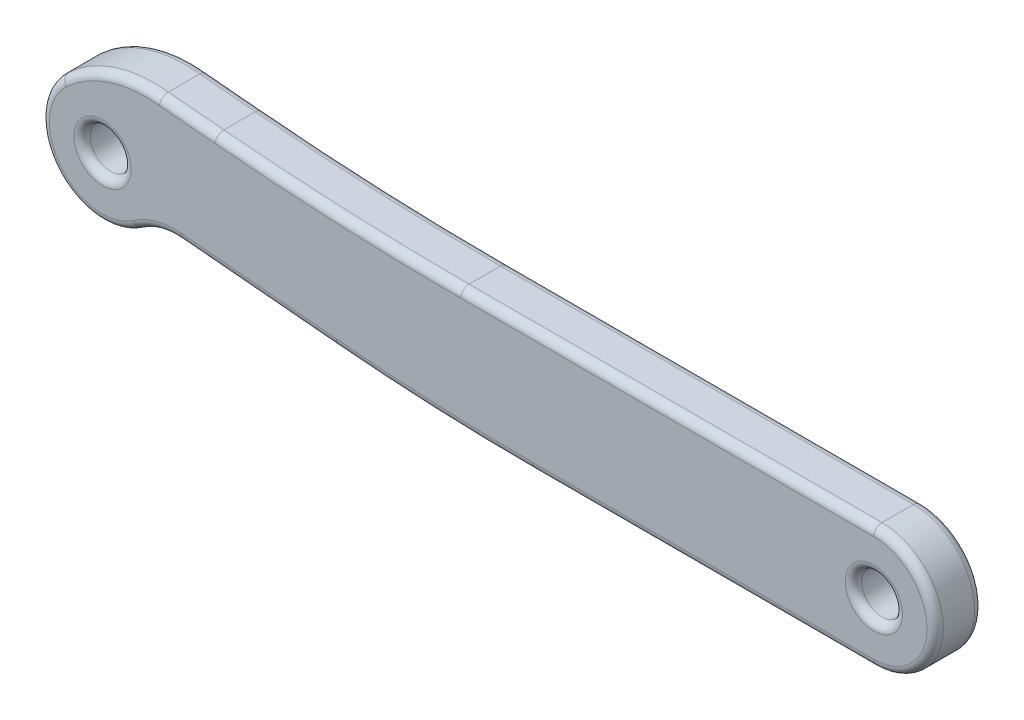
ISO-10303-21;
HEADER;
FILE_DESCRIPTION(('STEP AP214'),'2;1');
FILE_NAME('part.step','',(''),(''),'','','');
FILE_SCHEMA(('AUTOMOTIVE_DESIGN { 1 0 10303 214 1 1 1 1 }'));
ENDSEC;
DATA;
#1=APPLICATION_CONTEXT('core data for automotive mechanical design processes');
#2=APPLICATION_PROTOCOL_DEFINITION('international standard','automotive_design',2000,#1);
#3=PRODUCT_CONTEXT('',#1,'mechanical');
#4=PRODUCT('Part','Part','',(#3));
#5=PRODUCT_RELATED_PRODUCT_CATEGORY('part','',(#4));
#6=PRODUCT_DEFINITION_FORMATION('','',#4);
#7=PRODUCT_DEFINITION_CONTEXT('part definition',#1,'design');
#8=PRODUCT_DEFINITION('design','',#6,#7);
#9=PRODUCT_DEFINITION_SHAPE('','',#8);
#10=(LENGTH_UNIT() NAMED_UNIT(*) SI_UNIT(.MILLI.,.METRE.));
#11=(NAMED_UNIT(*) PLANE_ANGLE_UNIT() SI_UNIT($,.RADIAN.));
#12=(NAMED_UNIT(*) SI_UNIT($,.STERADIAN.) SOLID_ANGLE_UNIT());
#13=UNCERTAINTY_MEASURE_WITH_UNIT(LENGTH_MEASURE(1.E-05),#10,'distance_accuracy_value','');
#14=(GEOMETRIC_REPRESENTATION_CONTEXT(3) GLOBAL_UNCERTAINTY_ASSIGNED_CONTEXT((#13)) GLOBAL_UNIT_ASSIGNED_CONTEXT((#10,
#11,#12)) REPRESENTATION_CONTEXT('',''));
#15=CARTESIAN_POINT('',(0.,0.,0.));
#16=DIRECTION('',(0.,0.,1.));
#17=DIRECTION('',(1.,0.,0.));
#18=AXIS2_PLACEMENT_3D('',#15,#16,#17);
#19=CARTESIAN_POINT('',(0.,0.,1.75));
#20=DIRECTION('',(0.,0.,-1.));
#21=DIRECTION('',(-1.,0.,0.));
#22=AXIS2_PLACEMENT_3D('',#19,#20,#21);
#23=CYLINDRICAL_SURFACE('',#22,2.25);
#24=DIRECTION('',(0.,0.,1.));
#25=VECTOR('',#24,1.);
#26=CARTESIAN_POINT('',(-1.52467335470079,1.65465137157816,0.));
#27=LINE('',#26,#25);
#28=CARTESIAN_POINT('',(-1.52467335470079,1.65465137157816,0.3));
#29=VERTEX_POINT('',#28);
#30=CARTESIAN_POINT('',(-1.52467335470079,1.65465137157816,1.45));
#31=VERTEX_POINT('',#30);
#32=EDGE_CURVE('E458',#29,#31,#27,.T.);
#33=ORIENTED_EDGE('',*,*,#32,.F.);
#34=CARTESIAN_POINT('',(0.,0.,0.3));
#35=DIRECTION('',(0.,0.,1.));
#36=DIRECTION('',(1.,0.,0.));
#37=AXIS2_PLACEMENT_3D('',#34,#35,#36);
#38=CIRCLE('',#37,2.25);
#39=CARTESIAN_POINT('',(1.29610472523494,-1.83918801138537,0.3));
#40=VERTEX_POINT('',#39);
#41=EDGE_CURVE('E261',#29,#40,#38,.T.);
#42=ORIENTED_EDGE('',*,*,#41,.T.);
#43=DIRECTION('',(0.,0.,1.));
#44=VECTOR('',#43,1.);
#45=CARTESIAN_POINT('',(1.29610472523494,-1.83918801138537,0.));
#46=LINE('',#45,#44);
#47=CARTESIAN_POINT('',(1.29610472523494,-1.83918801138537,1.45));
#48=VERTEX_POINT('',#47);
#49=EDGE_CURVE('E405',#40,#48,#46,.T.);
#50=ORIENTED_EDGE('',*,*,#49,.T.);
#51=CARTESIAN_POINT('',(0.,0.,1.45));
#52=DIRECTION('',(0.,0.,1.));
#53=DIRECTION('',(1.,0.,0.));
#54=AXIS2_PLACEMENT_3D('',#51,#52,#53);
#55=CIRCLE('',#54,2.25);
#56=EDGE_CURVE('E259',#48,#31,#55,.F.);
#57=ORIENTED_EDGE('',*,*,#56,.T.);
#58=EDGE_LOOP('',(#33,#42,#50,#57));
#59=FACE_BOUND('',#58,.T.);
#60=ADVANCED_FACE('F34',(#59),#23,.T.);
#61=CARTESIAN_POINT('',(0.,2.25,1.75));
#62=DIRECTION('',(0.,-1.,0.));
#63=DIRECTION('',(0.,0.,-1.));
#64=AXIS2_PLACEMENT_3D('',#61,#62,#63);
#65=PLANE('',#64);
#66=DIRECTION('',(0.,0.,-1.));
#67=VECTOR('',#66,1.);
#68=CARTESIAN_POINT('',(28.32231193,2.25,1.75));
#69=LINE('',#68,#67);
#70=CARTESIAN_POINT('',(28.32231193,2.25,1.45));
#71=VERTEX_POINT('',#70);
#72=CARTESIAN_POINT('',(28.32231193,2.25,0.3));
#73=VERTEX_POINT('',#72);
#74=EDGE_CURVE('E403',#71,#73,#69,.T.);
#75=ORIENTED_EDGE('',*,*,#74,.T.);
#76=DIRECTION('',(-1.,0.,0.));
#77=VECTOR('',#76,1.);
#78=CARTESIAN_POINT('',(0.,2.25,0.3));
#79=LINE('',#78,#77);
#80=CARTESIAN_POINT('',(13.162158488708,2.25,0.3));
#81=VERTEX_POINT('',#80);
#82=EDGE_CURVE('E244',#73,#81,#79,.T.);
#83=ORIENTED_EDGE('',*,*,#82,.T.);
#84=DIRECTION('',(0.,0.,1.));
#85=VECTOR('',#84,1.);
#86=CARTESIAN_POINT('',(13.162158488708,2.25,0.));
#87=LINE('',#86,#85);
#88=CARTESIAN_POINT('',(13.162158488708,2.25,1.45));
#89=VERTEX_POINT('',#88);
#90=EDGE_CURVE('E475',#81,#89,#87,.T.);
#91=ORIENTED_EDGE('',*,*,#90,.T.);
#92=DIRECTION('',(-1.,0.,0.));
#93=VECTOR('',#92,1.);
#94=CARTESIAN_POINT('',(28.32231193,2.25,1.45));
#95=LINE('',#94,#93);
#96=EDGE_CURVE('E242',#89,#71,#95,.F.);
#97=ORIENTED_EDGE('',*,*,#96,.T.);
#98=EDGE_LOOP('',(#75,#83,#91,#97));
#99=FACE_BOUND('',#98,.T.);
#100=ADVANCED_FACE('F479',(#99),#65,.F.);
#101=CARTESIAN_POINT('',(0.,-2.25,1.75));
#102=DIRECTION('',(0.,1.,0.));
#103=DIRECTION('',(0.,0.,1.));
#104=AXIS2_PLACEMENT_3D('',#101,#102,#103);
#105=PLANE('',#104);
#106=DIRECTION('',(0.,0.,1.));
#107=VECTOR('',#106,1.);
#108=CARTESIAN_POINT('',(15.8071767602875,-2.25000000000006,0.));
#109=LINE('',#108,#107);
#110=CARTESIAN_POINT('',(15.8071767602875,-2.25000000000006,0.3));
#111=VERTEX_POINT('',#110);
#112=CARTESIAN_POINT('',(15.8071767602875,-2.25000000000006,1.45));
#113=VERTEX_POINT('',#112);
#114=EDGE_CURVE('E395',#111,#113,#109,.T.);
#115=ORIENTED_EDGE('',*,*,#114,.F.);
#116=DIRECTION('',(1.,0.,0.));
#117=VECTOR('',#116,1.);
#118=CARTESIAN_POINT('',(0.,-2.25,0.3));
#119=LINE('',#118,#117);
#120=CARTESIAN_POINT('',(28.32231193,-2.25,0.3));
#121=VERTEX_POINT('',#120);
#122=EDGE_CURVE('E236',#111,#121,#119,.T.);
#123=ORIENTED_EDGE('',*,*,#122,.T.);
#124=DIRECTION('',(0.,0.,-1.));
#125=VECTOR('',#124,1.);
#126=CARTESIAN_POINT('',(28.32231193,-2.25,1.75));
#127=LINE('',#126,#125);
#128=CARTESIAN_POINT('',(28.32231193,-2.25,1.45));
#129=VERTEX_POINT('',#128);
#130=EDGE_CURVE('E195',#129,#121,#127,.T.);
#131=ORIENTED_EDGE('',*,*,#130,.F.);
#132=DIRECTION('',(1.,0.,0.));
#133=VECTOR('',#132,1.);
#134=CARTESIAN_POINT('',(15.8071767602875,-2.25,1.45));
#135=LINE('',#134,#133);
#136=EDGE_CURVE('E234',#129,#113,#135,.F.);
#137=ORIENTED_EDGE('',*,*,#136,.T.);
#138=EDGE_LOOP('',(#115,#123,#131,#137));
#139=FACE_BOUND('',#138,.T.);
#140=ADVANCED_FACE('F495',(#139),#105,.F.);
#141=CARTESIAN_POINT('',(0.,0.,1.75));
#142=DIRECTION('',(0.,0.,1.));
#143=DIRECTION('',(1.,0.,0.));
#144=AXIS2_PLACEMENT_3D('',#141,#142,#143);
#145=PLANE('',#144);
#146=CARTESIAN_POINT('',(28.32231193,0.,1.75));
#147=DIRECTION('',(0.,0.,1.));
#148=DIRECTION('',(1.,0.,0.));
#149=AXIS2_PLACEMENT_3D('',#146,#147,#148);
#150=CIRCLE('',#149,1.05);
#151=CARTESIAN_POINT('',(29.37231193,0.,1.75));
#152=VERTEX_POINT('',#151);
#153=EDGE_CURVE('E12',#152,#152,#150,.F.);
#154=ORIENTED_EDGE('',*,*,#153,.T.);
#155=EDGE_LOOP('',(#154));
#156=FACE_BOUND('',#155,.T.);
#157=CARTESIAN_POINT('',(0.,0.,1.75));
#158=DIRECTION('',(0.,0.,1.));
#159=DIRECTION('',(1.,0.,0.));
#160=AXIS2_PLACEMENT_3D('',#157,#158,#159);
#161=CIRCLE('',#160,1.05);
#162=CARTESIAN_POINT('',(1.05,0.,1.75));
#163=VERTEX_POINT('',#162);
#164=EDGE_CURVE('E43',#163,#163,#161,.F.);
#165=ORIENTED_EDGE('',*,*,#164,.T.);
#166=EDGE_LOOP('',(#165));
#167=FACE_BOUND('',#166,.T.);
#168=CARTESIAN_POINT('',(13.162158488708,102.934591607014,1.75));
#169=DIRECTION('',(0.,0.,1.));
#170=DIRECTION('',(1.,0.,0.));
#171=AXIS2_PLACEMENT_3D('',#168,#169,#170);
#172=CIRCLE('',#171,100.984591607014);
#173=CARTESIAN_POINT('',(13.162158488708,1.95,1.75));
#174=VERTEX_POINT('',#173);
#175=CARTESIAN_POINT('',(4.1328255389998,2.35447981288885,1.75));
#176=VERTEX_POINT('',#175);
#177=EDGE_CURVE('E51',#174,#176,#172,.F.);
#178=ORIENTED_EDGE('',*,*,#177,.T.);
#179=DIRECTION('',(-0.995994638325983,0.0894129768316409,0.));
#180=VECTOR('',#179,1.);
#181=CARTESIAN_POINT('',(0.242718455459598,2.70370463915676,1.75));
#182=LINE('',#181,#180);
#183=CARTESIAN_POINT('',(2.09015922776099,2.53785517309011,1.75));
#184=VERTEX_POINT('',#183);
#185=EDGE_CURVE('E279',#176,#184,#182,.T.);
#186=ORIENTED_EDGE('',*,*,#185,.T.);
#187=CARTESIAN_POINT('',(1.58269722959737,-1.71762176709653,1.75));
#188=DIRECTION('',(0.,0.,1.));
#189=DIRECTION('',(1.,0.,0.));
#190=AXIS2_PLACEMENT_3D('',#187,#188,#189);
#191=CIRCLE('',#190,4.28562733657985);
#192=CARTESIAN_POINT('',(-1.32138357407402,1.43403118870108,1.75));
#193=VERTEX_POINT('',#192);
#194=EDGE_CURVE('E263',#184,#193,#191,.T.);
#195=ORIENTED_EDGE('',*,*,#194,.T.);
#196=CARTESIAN_POINT('',(0.,0.,1.75));
#197=DIRECTION('',(0.,0.,1.));
#198=DIRECTION('',(1.,0.,0.));
#199=AXIS2_PLACEMENT_3D('',#196,#197,#198);
#200=CIRCLE('',#199,1.95);
#201=CARTESIAN_POINT('',(1.12329076187028,-1.59396294320065,1.75));
#202=VERTEX_POINT('',#201);
#203=EDGE_CURVE('E265',#193,#202,#200,.T.);
#204=ORIENTED_EDGE('',*,*,#203,.T.);
#205=CARTESIAN_POINT('',(2.66557638606268,-3.78248457646024,1.75));
#206=DIRECTION('',(0.,0.,1.));
#207=DIRECTION('',(1.,0.,0.));
#208=AXIS2_PLACEMENT_3D('',#205,#206,#207);
#209=CIRCLE('',#208,2.67736286032277);
#210=CARTESIAN_POINT('',(2.90496736946259,-1.11584552272564,1.75));
#211=VERTEX_POINT('',#210);
#212=EDGE_CURVE('E267',#202,#211,#209,.F.);
#213=ORIENTED_EDGE('',*,*,#212,.T.);
#214=DIRECTION('',(0.995994638325983,-0.0894129768316325,0.));
#215=VECTOR('',#214,1.);
#216=CARTESIAN_POINT('',(-0.0761471648852078,-0.848223274035544,1.75));
#217=LINE('',#216,#215);
#218=CARTESIAN_POINT('',(8.60095043109571,-1.62718843756218,1.75));
#219=VERTEX_POINT('',#218);
#220=EDGE_CURVE('E269',#211,#219,#217,.T.);
#221=ORIENTED_EDGE('',*,*,#220,.T.);
#222=CARTESIAN_POINT('',(15.8071767602885,78.6448597680787,1.75));
#223=DIRECTION('',(0.,0.,1.));
#224=DIRECTION('',(1.,0.,0.));
#225=AXIS2_PLACEMENT_3D('',#222,#223,#224);
#226=CIRCLE('',#225,80.5948597680787);
#227=CARTESIAN_POINT('',(15.8071767602875,-1.95000000000006,1.75));
#228=VERTEX_POINT('',#227);
#229=EDGE_CURVE('E271',#219,#228,#226,.T.);
#230=ORIENTED_EDGE('',*,*,#229,.T.);
#231=DIRECTION('',(1.,0.,0.));
#232=VECTOR('',#231,1.);
#233=CARTESIAN_POINT('',(28.32231193,-1.95,1.75));
#234=LINE('',#233,#232);
#235=CARTESIAN_POINT('',(28.32231193,-1.95,1.75));
#236=VERTEX_POINT('',#235);
#237=EDGE_CURVE('E273',#228,#236,#234,.T.);
#238=ORIENTED_EDGE('',*,*,#237,.T.);
#239=CARTESIAN_POINT('',(28.32231193,0.,1.75));
#240=DIRECTION('',(0.,0.,1.));
#241=DIRECTION('',(1.,0.,0.));
#242=AXIS2_PLACEMENT_3D('',#239,#240,#241);
#243=CIRCLE('',#242,1.95);
#244=CARTESIAN_POINT('',(28.32231193,1.95,1.75));
#245=VERTEX_POINT('',#244);
#246=EDGE_CURVE('E275',#236,#245,#243,.T.);
#247=ORIENTED_EDGE('',*,*,#246,.T.);
#248=DIRECTION('',(-1.,0.,0.));
#249=VECTOR('',#248,1.);
#250=CARTESIAN_POINT('',(13.162158488708,1.95,1.75));
#251=LINE('',#250,#249);
#252=EDGE_CURVE('E56',#245,#174,#251,.T.);
#253=ORIENTED_EDGE('',*,*,#252,.T.);
#254=EDGE_LOOP('',(#178,#186,#195,#204,#213,#221,#230,#238,#247,#253));
#255=FACE_BOUND('',#254,.T.);
#256=ADVANCED_FACE('F719',(#156,#167,#255),#145,.T.);
#257=CARTESIAN_POINT('',(0.,0.,0.));
#258=DIRECTION('',(0.,0.,1.));
#259=DIRECTION('',(1.,0.,0.));
#260=AXIS2_PLACEMENT_3D('',#257,#258,#259);
#261=PLANE('',#260);
#262=CARTESIAN_POINT('',(28.32231193,0.,0.));
#263=DIRECTION('',(0.,0.,1.));
#264=DIRECTION('',(1.,0.,0.));
#265=AXIS2_PLACEMENT_3D('',#262,#263,#264);
#266=CIRCLE('',#265,1.05);
#267=CARTESIAN_POINT('',(29.37231193,0.,0.));
#268=VERTEX_POINT('',#267);
#269=EDGE_CURVE('E203',#268,#268,#266,.T.);
#270=ORIENTED_EDGE('',*,*,#269,.T.);
#271=EDGE_LOOP('',(#270));
#272=FACE_BOUND('',#271,.T.);
#273=CARTESIAN_POINT('',(0.,0.,0.));
#274=DIRECTION('',(0.,0.,1.));
#275=DIRECTION('',(1.,0.,0.));
#276=AXIS2_PLACEMENT_3D('',#273,#274,#275);
#277=CIRCLE('',#276,1.05);
#278=CARTESIAN_POINT('',(1.05,0.,0.));
#279=VERTEX_POINT('',#278);
#280=EDGE_CURVE('E200',#279,#279,#277,.T.);
#281=ORIENTED_EDGE('',*,*,#280,.T.);
#282=EDGE_LOOP('',(#281));
#283=FACE_BOUND('',#282,.T.);
#284=DIRECTION('',(0.995994638325983,-0.0894129768316325,0.));
#285=VECTOR('',#284,1.);
#286=CARTESIAN_POINT('',(2.90496736946259,-1.11584552272564,0.));
#287=LINE('',#286,#285);
#288=CARTESIAN_POINT('',(8.60095043109571,-1.62718843756216,0.));
#289=VERTEX_POINT('',#288);
#290=CARTESIAN_POINT('',(2.90496736946259,-1.11584552272564,0.));
#291=VERTEX_POINT('',#290);
#292=EDGE_CURVE('E199',#289,#291,#287,.F.);
#293=ORIENTED_EDGE('',*,*,#292,.T.);
#294=CARTESIAN_POINT('',(2.66557638606268,-3.78248457646024,0.));
#295=DIRECTION('',(0.,0.,1.));
#296=DIRECTION('',(1.,0.,0.));
#297=AXIS2_PLACEMENT_3D('',#294,#295,#296);
#298=CIRCLE('',#297,2.67736286032277);
#299=CARTESIAN_POINT('',(1.12329076187028,-1.59396294320065,0.));
#300=VERTEX_POINT('',#299);
#301=EDGE_CURVE('E178',#291,#300,#298,.T.);
#302=ORIENTED_EDGE('',*,*,#301,.T.);
#303=CARTESIAN_POINT('',(0.,0.,0.));
#304=DIRECTION('',(0.,0.,1.));
#305=DIRECTION('',(1.,0.,0.));
#306=AXIS2_PLACEMENT_3D('',#303,#304,#305);
#307=CIRCLE('',#306,1.95);
#308=CARTESIAN_POINT('',(-1.32138357407401,1.43403118870107,0.));
#309=VERTEX_POINT('',#308);
#310=EDGE_CURVE('E188',#300,#309,#307,.F.);
#311=ORIENTED_EDGE('',*,*,#310,.T.);
#312=CARTESIAN_POINT('',(1.58269722959737,-1.71762176709653,0.));
#313=DIRECTION('',(0.,0.,1.));
#314=DIRECTION('',(1.,0.,0.));
#315=AXIS2_PLACEMENT_3D('',#312,#313,#314);
#316=CIRCLE('',#315,4.28562733657985);
#317=CARTESIAN_POINT('',(2.090159227761,2.53785517309011,0.));
#318=VERTEX_POINT('',#317);
#319=EDGE_CURVE('E194',#309,#318,#316,.F.);
#320=ORIENTED_EDGE('',*,*,#319,.T.);
#321=DIRECTION('',(-0.995994638325983,0.0894129768316409,0.));
#322=VECTOR('',#321,1.);
#323=CARTESIAN_POINT('',(4.13282553899979,2.35447981288883,0.));
#324=LINE('',#323,#322);
#325=CARTESIAN_POINT('',(4.1328255389998,2.35447981288883,0.));
#326=VERTEX_POINT('',#325);
#327=EDGE_CURVE('E417',#318,#326,#324,.F.);
#328=ORIENTED_EDGE('',*,*,#327,.T.);
#329=CARTESIAN_POINT('',(13.162158488708,102.934591607014,0.));
#330=DIRECTION('',(0.,0.,1.));
#331=DIRECTION('',(1.,0.,0.));
#332=AXIS2_PLACEMENT_3D('',#329,#330,#331);
#333=CIRCLE('',#332,100.984591607014);
#334=CARTESIAN_POINT('',(13.162158488708,1.95,0.));
#335=VERTEX_POINT('',#334);
#336=EDGE_CURVE('E419',#326,#335,#333,.T.);
#337=ORIENTED_EDGE('',*,*,#336,.T.);
#338=DIRECTION('',(-1.,0.,0.));
#339=VECTOR('',#338,1.);
#340=CARTESIAN_POINT('',(0.,1.95,0.));
#341=LINE('',#340,#339);
#342=CARTESIAN_POINT('',(28.32231193,1.95,0.));
#343=VERTEX_POINT('',#342);
#344=EDGE_CURVE('E421',#335,#343,#341,.F.);
#345=ORIENTED_EDGE('',*,*,#344,.T.);
#346=CARTESIAN_POINT('',(28.32231193,0.,0.));
#347=DIRECTION('',(0.,0.,1.));
#348=DIRECTION('',(1.,0.,0.));
#349=AXIS2_PLACEMENT_3D('',#346,#347,#348);
#350=CIRCLE('',#349,1.95);
#351=CARTESIAN_POINT('',(28.32231193,-1.95,0.));
#352=VERTEX_POINT('',#351);
#353=EDGE_CURVE('E423',#343,#352,#350,.F.);
#354=ORIENTED_EDGE('',*,*,#353,.T.);
#355=DIRECTION('',(1.,0.,0.));
#356=VECTOR('',#355,1.);
#357=CARTESIAN_POINT('',(0.,-1.95,0.));
#358=LINE('',#357,#356);
#359=CARTESIAN_POINT('',(15.8071767602875,-1.95,0.));
#360=VERTEX_POINT('',#359);
#361=EDGE_CURVE('E425',#352,#360,#358,.F.);
#362=ORIENTED_EDGE('',*,*,#361,.T.);
#363=CARTESIAN_POINT('',(15.8071767602885,78.6448597680787,0.));
#364=DIRECTION('',(0.,0.,1.));
#365=DIRECTION('',(1.,0.,0.));
#366=AXIS2_PLACEMENT_3D('',#363,#364,#365);
#367=CIRCLE('',#366,80.5948597680787);
#368=EDGE_CURVE('E205',#360,#289,#367,.F.);
#369=ORIENTED_EDGE('',*,*,#368,.T.);
#370=EDGE_LOOP('',(#293,#302,#311,#320,#328,#337,#345,#354,#362,#369));
#371=FACE_BOUND('',#370,.T.);
#372=ADVANCED_FACE('F197',(#272,#283,#371),#261,.F.);
#373=CARTESIAN_POINT('',(28.32231193,0.,1.75));
#374=DIRECTION('',(0.,0.,-1.));
#375=DIRECTION('',(-1.,0.,0.));
#376=AXIS2_PLACEMENT_3D('',#373,#374,#375);
#377=CYLINDRICAL_SURFACE('',#376,2.25);
#378=ORIENTED_EDGE('',*,*,#130,.T.);
#379=CARTESIAN_POINT('',(28.32231193,0.,0.3));
#380=DIRECTION('',(0.,0.,1.));
#381=DIRECTION('',(1.,0.,0.));
#382=AXIS2_PLACEMENT_3D('',#379,#380,#381);
#383=CIRCLE('',#382,2.25);
#384=EDGE_CURVE('E240',#121,#73,#383,.T.);
#385=ORIENTED_EDGE('',*,*,#384,.T.);
#386=ORIENTED_EDGE('',*,*,#74,.F.);
#387=CARTESIAN_POINT('',(28.32231193,0.,1.45));
#388=DIRECTION('',(0.,0.,1.));
#389=DIRECTION('',(1.,0.,0.));
#390=AXIS2_PLACEMENT_3D('',#387,#388,#389);
#391=CIRCLE('',#390,2.25);
#392=EDGE_CURVE('E238',#71,#129,#391,.F.);
#393=ORIENTED_EDGE('',*,*,#392,.T.);
#394=EDGE_LOOP('',(#378,#385,#386,#393));
#395=FACE_BOUND('',#394,.T.);
#396=ADVANCED_FACE('F492',(#395),#377,.T.);
#397=CARTESIAN_POINT('',(0.,0.,1.75));
#398=DIRECTION('',(0.,0.,-1.));
#399=DIRECTION('',(-1.,0.,0.));
#400=AXIS2_PLACEMENT_3D('',#397,#398,#399);
#401=CYLINDRICAL_SURFACE('',#400,0.75);
#402=CARTESIAN_POINT('',(0.,0.,0.3));
#403=DIRECTION('',(0.,0.,1.));
#404=DIRECTION('',(1.,0.,0.));
#405=AXIS2_PLACEMENT_3D('',#402,#403,#404);
#406=CIRCLE('',#405,0.75);
#407=CARTESIAN_POINT('',(0.75,0.,0.3));
#408=VERTEX_POINT('',#407);
#409=EDGE_CURVE('E220',#408,#408,#406,.F.);
#410=ORIENTED_EDGE('',*,*,#409,.T.);
#411=EDGE_LOOP('',(#410));
#412=FACE_BOUND('',#411,.T.);
#413=CARTESIAN_POINT('',(0.,0.,1.45));
#414=DIRECTION('',(0.,0.,1.));
#415=DIRECTION('',(1.,0.,0.));
#416=AXIS2_PLACEMENT_3D('',#413,#414,#415);
#417=CIRCLE('',#416,0.75);
#418=CARTESIAN_POINT('',(0.75,0.,1.45));
#419=VERTEX_POINT('',#418);
#420=EDGE_CURVE('E217',#419,#419,#417,.T.);
#421=ORIENTED_EDGE('',*,*,#420,.T.);
#422=EDGE_LOOP('',(#421));
#423=FACE_BOUND('',#422,.T.);
#424=ADVANCED_FACE('F765',(#412,#423),#401,.F.);
#425=CARTESIAN_POINT('',(28.32231193,0.,1.75));
#426=DIRECTION('',(0.,0.,-1.));
#427=DIRECTION('',(-1.,0.,0.));
#428=AXIS2_PLACEMENT_3D('',#425,#426,#427);
#429=CYLINDRICAL_SURFACE('',#428,0.750000000000002);
#430=CARTESIAN_POINT('',(28.32231193,0.,0.3));
#431=DIRECTION('',(0.,0.,1.));
#432=DIRECTION('',(1.,0.,0.));
#433=AXIS2_PLACEMENT_3D('',#430,#431,#432);
#434=CIRCLE('',#433,0.750000000000002);
#435=CARTESIAN_POINT('',(29.07231193,0.,0.3));
#436=VERTEX_POINT('',#435);
#437=EDGE_CURVE('E214',#436,#436,#434,.F.);
#438=ORIENTED_EDGE('',*,*,#437,.T.);
#439=EDGE_LOOP('',(#438));
#440=FACE_BOUND('',#439,.T.);
#441=CARTESIAN_POINT('',(28.32231193,0.,1.45));
#442=DIRECTION('',(0.,0.,1.));
#443=DIRECTION('',(1.,0.,0.));
#444=AXIS2_PLACEMENT_3D('',#441,#442,#443);
#445=CIRCLE('',#444,0.750000000000002);
#446=CARTESIAN_POINT('',(29.07231193,0.,1.45));
#447=VERTEX_POINT('',#446);
#448=EDGE_CURVE('E211',#447,#447,#445,.T.);
#449=ORIENTED_EDGE('',*,*,#448,.T.);
#450=EDGE_LOOP('',(#449));
#451=FACE_BOUND('',#450,.T.);
#452=ADVANCED_FACE('F770',(#440,#451),#429,.F.);
#453=CARTESIAN_POINT('',(15.8071767602885,78.6448597680787,0.));
#454=DIRECTION('',(0.,0.,1.));
#455=DIRECTION('',(1.,0.,0.));
#456=AXIS2_PLACEMENT_3D('',#453,#454,#455);
#457=CYLINDRICAL_SURFACE('',#456,80.8948597680787);
#458=DIRECTION('',(0.,0.,1.));
#459=VECTOR('',#458,1.);
#460=CARTESIAN_POINT('',(8.57412653804622,-1.92598682905998,0.));
#461=LINE('',#460,#459);
#462=CARTESIAN_POINT('',(8.57412653804622,-1.92598682905998,0.3));
#463=VERTEX_POINT('',#462);
#464=CARTESIAN_POINT('',(8.57412653804622,-1.92598682905998,1.45));
#465=VERTEX_POINT('',#464);
#466=EDGE_CURVE('E392',#463,#465,#461,.T.);
#467=ORIENTED_EDGE('',*,*,#466,.F.);
#468=CARTESIAN_POINT('',(15.8071767602885,78.6448597680787,0.3));
#469=DIRECTION('',(0.,0.,1.));
#470=DIRECTION('',(1.,0.,0.));
#471=AXIS2_PLACEMENT_3D('',#468,#469,#470);
#472=CIRCLE('',#471,80.8948597680787);
#473=EDGE_CURVE('E232',#463,#111,#472,.T.);
#474=ORIENTED_EDGE('',*,*,#473,.T.);
#475=ORIENTED_EDGE('',*,*,#114,.T.);
#476=CARTESIAN_POINT('',(15.8071767602885,78.6448597680787,1.45));
#477=DIRECTION('',(0.,0.,1.));
#478=DIRECTION('',(1.,0.,0.));
#479=AXIS2_PLACEMENT_3D('',#476,#477,#478);
#480=CIRCLE('',#479,80.8948597680787);
#481=EDGE_CURVE('E230',#113,#465,#480,.F.);
#482=ORIENTED_EDGE('',*,*,#481,.T.);
#483=EDGE_LOOP('',(#467,#474,#475,#482));
#484=FACE_BOUND('',#483,.T.);
#485=ADVANCED_FACE('F391',(#484),#457,.T.);
#486=CARTESIAN_POINT('',(2.8781434764131,-1.41464391422344,0.));
#487=DIRECTION('',(-0.0894129768316325,-0.995994638325983,0.));
#488=DIRECTION('',(0.995994638325983,-0.0894129768316325,0.));
#489=AXIS2_PLACEMENT_3D('',#486,#487,#488);
#490=PLANE('',#489);
#491=DIRECTION('',(0.,0.,1.));
#492=VECTOR('',#491,1.);
#493=CARTESIAN_POINT('',(2.8781434764131,-1.41464391422344,0.));
#494=LINE('',#493,#492);
#495=CARTESIAN_POINT('',(2.8781434764131,-1.41464391422344,0.3));
#496=VERTEX_POINT('',#495);
#497=CARTESIAN_POINT('',(2.8781434764131,-1.41464391422344,1.45));
#498=VERTEX_POINT('',#497);
#499=EDGE_CURVE('E401',#496,#498,#494,.T.);
#500=ORIENTED_EDGE('',*,*,#499,.F.);
#501=DIRECTION('',(0.995994638325983,-0.0894129768316325,0.));
#502=VECTOR('',#501,1.);
#503=CARTESIAN_POINT('',(8.57412653804622,-1.92598682905998,0.3));
#504=LINE('',#503,#502);
#505=EDGE_CURVE('E228',#496,#463,#504,.T.);
#506=ORIENTED_EDGE('',*,*,#505,.T.);
#507=ORIENTED_EDGE('',*,*,#466,.T.);
#508=DIRECTION('',(0.995994638325983,-0.0894129768316325,0.));
#509=VECTOR('',#508,1.);
#510=CARTESIAN_POINT('',(2.8781434764131,-1.41464391422344,1.45));
#511=LINE('',#510,#509);
#512=EDGE_CURVE('E226',#465,#498,#511,.F.);
#513=ORIENTED_EDGE('',*,*,#512,.T.);
#514=EDGE_LOOP('',(#500,#506,#507,#513));
#515=FACE_BOUND('',#514,.T.);
#516=ADVANCED_FACE('F398',(#515),#490,.T.);
#517=CARTESIAN_POINT('',(2.66557638606268,-3.78248457646024,0.));
#518=DIRECTION('',(0.,0.,1.));
#519=DIRECTION('',(1.,0.,0.));
#520=AXIS2_PLACEMENT_3D('',#517,#518,#519);
#521=CYLINDRICAL_SURFACE('',#520,2.37736286032277);
#522=ORIENTED_EDGE('',*,*,#49,.F.);
#523=CARTESIAN_POINT('',(2.66557638606268,-3.78248457646024,0.3));
#524=DIRECTION('',(0.,0.,1.));
#525=DIRECTION('',(1.,0.,0.));
#526=AXIS2_PLACEMENT_3D('',#523,#524,#525);
#527=CIRCLE('',#526,2.37736286032277);
#528=EDGE_CURVE('E181',#40,#496,#527,.F.);
#529=ORIENTED_EDGE('',*,*,#528,.T.);
#530=ORIENTED_EDGE('',*,*,#499,.T.);
#531=CARTESIAN_POINT('',(2.66557638606268,-3.78248457646024,1.45));
#532=DIRECTION('',(0.,0.,1.));
#533=DIRECTION('',(1.,0.,0.));
#534=AXIS2_PLACEMENT_3D('',#531,#532,#533);
#535=CIRCLE('',#534,2.37736286032277);
#536=EDGE_CURVE('E223',#498,#48,#535,.T.);
#537=ORIENTED_EDGE('',*,*,#536,.T.);
#538=EDGE_LOOP('',(#522,#529,#530,#537));
#539=FACE_BOUND('',#538,.T.);
#540=ADVANCED_FACE('F435',(#539),#521,.F.);
#541=CARTESIAN_POINT('',(1.58269722959737,-1.71762176709653,0.));
#542=DIRECTION('',(0.,0.,1.));
#543=DIRECTION('',(1.,0.,0.));
#544=AXIS2_PLACEMENT_3D('',#541,#542,#543);
#545=CYLINDRICAL_SURFACE('',#544,4.58562733657985);
#546=DIRECTION('',(0.,0.,1.));
#547=VECTOR('',#546,1.);
#548=CARTESIAN_POINT('',(2.1212656371183,2.83626911218558,0.));
#549=LINE('',#548,#547);
#550=CARTESIAN_POINT('',(2.1212656371183,2.83626911218558,0.3));
#551=VERTEX_POINT('',#550);
#552=CARTESIAN_POINT('',(2.1212656371183,2.83626911218558,1.45));
#553=VERTEX_POINT('',#552);
#554=EDGE_CURVE('E411',#551,#553,#549,.T.);
#555=ORIENTED_EDGE('',*,*,#554,.F.);
#556=CARTESIAN_POINT('',(1.58269722959737,-1.71762176709653,0.3));
#557=DIRECTION('',(0.,0.,1.));
#558=DIRECTION('',(1.,0.,0.));
#559=AXIS2_PLACEMENT_3D('',#556,#557,#558);
#560=CIRCLE('',#559,4.58562733657985);
#561=EDGE_CURVE('E257',#551,#29,#560,.T.);
#562=ORIENTED_EDGE('',*,*,#561,.T.);
#563=ORIENTED_EDGE('',*,*,#32,.T.);
#564=CARTESIAN_POINT('',(1.58269722959737,-1.71762176709653,1.45));
#565=DIRECTION('',(0.,0.,1.));
#566=DIRECTION('',(1.,0.,0.));
#567=AXIS2_PLACEMENT_3D('',#564,#565,#566);
#568=CIRCLE('',#567,4.58562733657985);
#569=EDGE_CURVE('E255',#31,#553,#568,.F.);
#570=ORIENTED_EDGE('',*,*,#569,.T.);
#571=EDGE_LOOP('',(#555,#562,#563,#570));
#572=FACE_BOUND('',#571,.T.);
#573=ADVANCED_FACE('F456',(#572),#545,.T.);
#574=CARTESIAN_POINT('',(2.1212656371183,2.83626911218558,0.));
#575=DIRECTION('',(0.0894129768316409,0.995994638325982,0.));
#576=DIRECTION('',(-0.995994638325983,0.0894129768316409,0.));
#577=AXIS2_PLACEMENT_3D('',#574,#575,#576);
#578=PLANE('',#577);
#579=DIRECTION('',(0.,0.,1.));
#580=VECTOR('',#579,1.);
#581=CARTESIAN_POINT('',(4.15964943204929,2.65327820438663,0.));
#582=LINE('',#581,#580);
#583=CARTESIAN_POINT('',(4.15964943204929,2.65327820438663,0.3));
#584=VERTEX_POINT('',#583);
#585=CARTESIAN_POINT('',(4.15964943204929,2.65327820438663,1.45));
#586=VERTEX_POINT('',#585);
#587=EDGE_CURVE('E465',#584,#586,#582,.T.);
#588=ORIENTED_EDGE('',*,*,#587,.F.);
#589=DIRECTION('',(-0.995994638325983,0.0894129768316409,0.));
#590=VECTOR('',#589,1.);
#591=CARTESIAN_POINT('',(2.1212656371183,2.83626911218558,0.3));
#592=LINE('',#591,#590);
#593=EDGE_CURVE('E253',#584,#551,#592,.T.);
#594=ORIENTED_EDGE('',*,*,#593,.T.);
#595=ORIENTED_EDGE('',*,*,#554,.T.);
#596=DIRECTION('',(-0.995994638325983,0.0894129768316409,0.));
#597=VECTOR('',#596,1.);
#598=CARTESIAN_POINT('',(2.1212656371183,2.83626911218558,1.45));
#599=LINE('',#598,#597);
#600=EDGE_CURVE('E250',#553,#586,#599,.F.);
#601=ORIENTED_EDGE('',*,*,#600,.T.);
#602=EDGE_LOOP('',(#588,#594,#595,#601));
#603=FACE_BOUND('',#602,.T.);
#604=ADVANCED_FACE('F462',(#603),#578,.T.);
#605=CARTESIAN_POINT('',(13.162158488708,102.934591607014,0.));
#606=DIRECTION('',(0.,0.,1.));
#607=DIRECTION('',(1.,0.,0.));
#608=AXIS2_PLACEMENT_3D('',#605,#606,#607);
#609=CYLINDRICAL_SURFACE('',#608,100.684591607014);
#610=ORIENTED_EDGE('',*,*,#90,.F.);
#611=CARTESIAN_POINT('',(13.162158488708,102.934591607014,0.3));
#612=DIRECTION('',(0.,0.,1.));
#613=DIRECTION('',(1.,0.,0.));
#614=AXIS2_PLACEMENT_3D('',#611,#612,#613);
#615=CIRCLE('',#614,100.684591607014);
#616=EDGE_CURVE('E248',#81,#584,#615,.F.);
#617=ORIENTED_EDGE('',*,*,#616,.T.);
#618=ORIENTED_EDGE('',*,*,#587,.T.);
#619=CARTESIAN_POINT('',(13.162158488708,102.934591607014,1.45));
#620=DIRECTION('',(0.,0.,1.));
#621=DIRECTION('',(1.,0.,0.));
#622=AXIS2_PLACEMENT_3D('',#619,#620,#621);
#623=CIRCLE('',#622,100.684591607014);
#624=EDGE_CURVE('E246',#586,#89,#623,.T.);
#625=ORIENTED_EDGE('',*,*,#624,.T.);
#626=EDGE_LOOP('',(#610,#617,#618,#625));
#627=FACE_BOUND('',#626,.T.);
#628=ADVANCED_FACE('F474',(#627),#609,.F.);
#629=CARTESIAN_POINT('',(28.32231193,0.,0.3));
#630=DIRECTION('',(0.,0.,1.));
#631=DIRECTION('',(1.,0.,0.));
#632=AXIS2_PLACEMENT_3D('',#629,#630,#631);
#633=TOROIDAL_SURFACE('',#632,1.05,0.3);
#634=ORIENTED_EDGE('',*,*,#437,.F.);
#635=EDGE_LOOP('',(#634));
#636=FACE_BOUND('',#635,.T.);
#637=ORIENTED_EDGE('',*,*,#269,.F.);
#638=EDGE_LOOP('',(#637));
#639=FACE_BOUND('',#638,.T.);
#640=ADVANCED_FACE('F526',(#636,#639),#633,.T.);
#641=CARTESIAN_POINT('',(0.,0.,0.3));
#642=DIRECTION('',(0.,0.,1.));
#643=DIRECTION('',(1.,0.,0.));
#644=AXIS2_PLACEMENT_3D('',#641,#642,#643);
#645=TOROIDAL_SURFACE('',#644,1.05,0.3);
#646=ORIENTED_EDGE('',*,*,#409,.F.);
#647=EDGE_LOOP('',(#646));
#648=FACE_BOUND('',#647,.T.);
#649=ORIENTED_EDGE('',*,*,#280,.F.);
#650=EDGE_LOOP('',(#649));
#651=FACE_BOUND('',#650,.T.);
#652=ADVANCED_FACE('F324',(#648,#651),#645,.T.);
#653=CARTESIAN_POINT('',(0.,1.95,0.3));
#654=DIRECTION('',(-1.,0.,0.));
#655=DIRECTION('',(0.,0.,1.));
#656=AXIS2_PLACEMENT_3D('',#653,#654,#655);
#657=CYLINDRICAL_SURFACE('',#656,0.3);
#658=CARTESIAN_POINT('',(28.32231193,1.95,0.3));
#659=DIRECTION('',(1.,0.,0.));
#660=DIRECTION('',(0.,0.,-1.));
#661=AXIS2_PLACEMENT_3D('',#658,#659,#660);
#662=CIRCLE('',#661,0.3);
#663=EDGE_CURVE('E502',#343,#73,#662,.T.);
#664=ORIENTED_EDGE('',*,*,#663,.F.);
#665=ORIENTED_EDGE('',*,*,#344,.F.);
#666=CARTESIAN_POINT('',(13.162158488708,1.95,0.3));
#667=DIRECTION('',(-1.,0.,0.));
#668=DIRECTION('',(0.,0.,1.));
#669=AXIS2_PLACEMENT_3D('',#666,#667,#668);
#670=CIRCLE('',#669,0.3);
#671=EDGE_CURVE('E351',#81,#335,#670,.T.);
#672=ORIENTED_EDGE('',*,*,#671,.F.);
#673=ORIENTED_EDGE('',*,*,#82,.F.);
#674=EDGE_LOOP('',(#664,#665,#672,#673));
#675=FACE_BOUND('',#674,.T.);
#676=ADVANCED_FACE('F320',(#675),#657,.T.);
#677=CARTESIAN_POINT('',(13.162158488708,102.934591607014,0.3));
#678=DIRECTION('',(0.,0.,1.));
#679=DIRECTION('',(1.,0.,0.));
#680=AXIS2_PLACEMENT_3D('',#677,#678,#679);
#681=TOROIDAL_SURFACE('',#680,100.984591607014,0.3);
#682=ORIENTED_EDGE('',*,*,#671,.T.);
#683=ORIENTED_EDGE('',*,*,#336,.F.);
#684=CARTESIAN_POINT('',(4.1328255389998,2.35447981288883,0.3));
#685=DIRECTION('',(-0.995994638325985,0.0894129768316155,0.));
#686=DIRECTION('',(-0.0894129768316155,-0.995994638325985,0.));
#687=AXIS2_PLACEMENT_3D('',#684,#685,#686);
#688=CIRCLE('',#687,0.3);
#689=EDGE_CURVE('E500',#584,#326,#688,.T.);
#690=ORIENTED_EDGE('',*,*,#689,.F.);
#691=ORIENTED_EDGE('',*,*,#616,.F.);
#692=EDGE_LOOP('',(#682,#683,#690,#691));
#693=FACE_BOUND('',#692,.T.);
#694=ADVANCED_FACE('F316',(#693),#681,.T.);
#695=CARTESIAN_POINT('',(28.32231193,0.,0.3));
#696=DIRECTION('',(0.,0.,1.));
#697=DIRECTION('',(1.,0.,0.));
#698=AXIS2_PLACEMENT_3D('',#695,#696,#697);
#699=TOROIDAL_SURFACE('',#698,1.95,0.3);
#700=ORIENTED_EDGE('',*,*,#663,.T.);
#701=ORIENTED_EDGE('',*,*,#384,.F.);
#702=CARTESIAN_POINT('',(28.32231193,-1.95,0.3));
#703=DIRECTION('',(-1.,0.,0.));
#704=DIRECTION('',(0.,0.,1.));
#705=AXIS2_PLACEMENT_3D('',#702,#703,#704);
#706=CIRCLE('',#705,0.3);
#707=EDGE_CURVE('E298',#352,#121,#706,.T.);
#708=ORIENTED_EDGE('',*,*,#707,.F.);
#709=ORIENTED_EDGE('',*,*,#353,.F.);
#710=EDGE_LOOP('',(#700,#701,#708,#709));
#711=FACE_BOUND('',#710,.T.);
#712=ADVANCED_FACE('F313',(#711),#699,.T.);
#713=CARTESIAN_POINT('',(2.09444174406881,2.53747072068778,0.3));
#714=DIRECTION('',(0.995994638325983,-0.0894129768316409,0.));
#715=DIRECTION('',(0.0894129768316409,0.995994638325983,0.));
#716=AXIS2_PLACEMENT_3D('',#713,#714,#715);
#717=CYLINDRICAL_SURFACE('',#716,0.3);
#718=ORIENTED_EDGE('',*,*,#689,.T.);
#719=ORIENTED_EDGE('',*,*,#327,.F.);
#720=CARTESIAN_POINT('',(2.1212656371183,2.83626911218558,0.3));
#721=CARTESIAN_POINT('',(2.12126710195287,2.83628337934528,0.283124440537859));
#722=CARTESIAN_POINT('',(2.1211184200928,2.83485354220135,0.266253169150532));
#723=CARTESIAN_POINT('',(2.12053154773279,2.8292107022637,0.232999427126597));
#724=CARTESIAN_POINT('',(2.1200935611735,2.82499966003562,0.216616620651045));
#725=CARTESIAN_POINT('',(2.11893855650489,2.81389649173755,0.184787236715818));
#726=CARTESIAN_POINT('',(2.11822140327523,2.80700306735997,0.169341116815403));
#727=CARTESIAN_POINT('',(2.11652887849002,2.79073769168995,0.139835502839893));
#728=CARTESIAN_POINT('',(2.11555357627593,2.78136640597713,0.125775637792434));
#729=CARTESIAN_POINT('',(2.11337200336979,2.76041017801023,0.099437705648909));
#730=CARTESIAN_POINT('',(2.11216574638709,2.74882536714996,0.0871595328684971));
#731=CARTESIAN_POINT('',(2.10955543071827,2.72376399312111,0.0647267159621618));
#732=CARTESIAN_POINT('',(2.10815127847255,2.71028653517045,0.0545730819356577));
#733=CARTESIAN_POINT('',(2.10518458184035,2.68182145391088,0.0366799300072639));
#734=CARTESIAN_POINT('',(2.10362194253454,2.66683292564076,0.0289418702620467));
#735=CARTESIAN_POINT('',(2.10038421801758,2.63578936556684,0.0161159886855948));
#736=CARTESIAN_POINT('',(2.09870930362374,2.61973595426647,0.0110242395837027));
#737=CARTESIAN_POINT('',(2.09622393689693,2.59592436137297,0.00563394716786839));
#738=CARTESIAN_POINT('',(2.0954381788849,2.58839759962837,0.00423418368665576));
#739=CARTESIAN_POINT('',(2.09385812048642,2.57326507152639,0.00202077372306828));
#740=CARTESIAN_POINT('',(2.09306382956235,2.56565939294891,0.00120653478892483));
#741=CARTESIAN_POINT('',(2.09156577831875,2.55131760457772,0.000228812353332336));
#742=CARTESIAN_POINT('',(2.09086250929124,2.54458587746702,-6.56929012365607E-07));
#743=CARTESIAN_POINT('',(2.09015922776103,2.53785517309011,0.));
#744=B_SPLINE_CURVE_WITH_KNOTS('',3,(#720,#721,#722,#723,#724,#725,#726,#727,#728,#729,#730,
#731,#732,#733,#734,#735,#736,#737,#738,#739,#740,#741,#742,#743),.UNSPECIFIED.,.F.,.F.,(4,2,2,
2,2,2,2,2,2,2,2,4),(0.,0.0505594169911403,0.101083230923838,0.151631529513352,0.20216626406743,
0.252697999834606,0.303253706298971,0.353839871865443,0.404350748854499,0.427420975572763,
0.450467826153511,0.470768251114433),.UNSPECIFIED.);
#745=EDGE_CURVE('E290',#551,#318,#744,.T.);
#746=ORIENTED_EDGE('',*,*,#745,.F.);
#747=ORIENTED_EDGE('',*,*,#593,.F.);
#748=EDGE_LOOP('',(#718,#719,#746,#747));
#749=FACE_BOUND('',#748,.T.);
#750=ADVANCED_FACE('F300',(#749),#717,.T.);
#751=CARTESIAN_POINT('',(0.,-1.95,0.3));
#752=DIRECTION('',(1.,0.,0.));
#753=DIRECTION('',(0.,0.,-1.));
#754=AXIS2_PLACEMENT_3D('',#751,#752,#753);
#755=CYLINDRICAL_SURFACE('',#754,0.3);
#756=ORIENTED_EDGE('',*,*,#707,.T.);
#757=ORIENTED_EDGE('',*,*,#122,.F.);
#758=CARTESIAN_POINT('',(15.8071767602875,-1.95,0.3));
#759=DIRECTION('',(-1.,0.,0.));
#760=DIRECTION('',(0.,-1.,0.));
#761=AXIS2_PLACEMENT_3D('',#758,#759,#760);
#762=CIRCLE('',#761,0.3);
#763=EDGE_CURVE('E287',#360,#111,#762,.T.);
#764=ORIENTED_EDGE('',*,*,#763,.F.);
#765=ORIENTED_EDGE('',*,*,#361,.F.);
#766=EDGE_LOOP('',(#756,#757,#764,#765));
#767=FACE_BOUND('',#766,.T.);
#768=ADVANCED_FACE('F308',(#767),#755,.T.);
#769=CARTESIAN_POINT('',(1.58269722959737,-1.71762176709653,0.3));
#770=DIRECTION('',(0.,0.,1.));
#771=DIRECTION('',(1.,0.,0.));
#772=AXIS2_PLACEMENT_3D('',#769,#770,#771);
#773=TOROIDAL_SURFACE('',#772,4.28562733657985,0.3);
#774=ORIENTED_EDGE('',*,*,#745,.T.);
#775=ORIENTED_EDGE('',*,*,#319,.F.);
#776=CARTESIAN_POINT('',(-1.32138357407402,1.43403118870108,0.3));
#777=DIRECTION('',(-0.735400609590285,-0.677632602089242,0.));
#778=DIRECTION('',(0.677632602089242,-0.735400609590285,0.));
#779=AXIS2_PLACEMENT_3D('',#776,#777,#778);
#780=CIRCLE('',#779,0.3);
#781=EDGE_CURVE('E191',#29,#309,#780,.T.);
#782=ORIENTED_EDGE('',*,*,#781,.F.);
#783=ORIENTED_EDGE('',*,*,#561,.F.);
#784=EDGE_LOOP('',(#774,#775,#782,#783));
#785=FACE_BOUND('',#784,.T.);
#786=ADVANCED_FACE('F303',(#785),#773,.T.);
#787=CARTESIAN_POINT('',(15.8071767602885,78.6448597680787,0.3));
#788=DIRECTION('',(0.,0.,1.));
#789=DIRECTION('',(1.,0.,0.));
#790=AXIS2_PLACEMENT_3D('',#787,#788,#789);
#791=TOROIDAL_SURFACE('',#790,80.5948597680787,0.3);
#792=ORIENTED_EDGE('',*,*,#763,.T.);
#793=ORIENTED_EDGE('',*,*,#473,.F.);
#794=CARTESIAN_POINT('',(8.60095043109571,-1.62718843756216,0.3));
#795=DIRECTION('',(-0.995994638325984,0.0894129768316284,0.));
#796=DIRECTION('',(-0.0894129768316284,-0.995994638325984,0.));
#797=AXIS2_PLACEMENT_3D('',#794,#795,#796);
#798=CIRCLE('',#797,0.3);
#799=EDGE_CURVE('E184',#289,#463,#798,.T.);
#800=ORIENTED_EDGE('',*,*,#799,.F.);
#801=ORIENTED_EDGE('',*,*,#368,.F.);
#802=EDGE_LOOP('',(#792,#793,#800,#801));
#803=FACE_BOUND('',#802,.T.);
#804=ADVANCED_FACE('F307',(#803),#791,.T.);
#805=CARTESIAN_POINT('',(0.,0.,0.3));
#806=DIRECTION('',(0.,0.,1.));
#807=DIRECTION('',(1.,0.,0.));
#808=AXIS2_PLACEMENT_3D('',#805,#806,#807);
#809=TOROIDAL_SURFACE('',#808,1.95,0.3);
#810=ORIENTED_EDGE('',*,*,#781,.T.);
#811=ORIENTED_EDGE('',*,*,#310,.F.);
#812=CARTESIAN_POINT('',(1.12329076187028,-1.59396294320065,0.3));
#813=DIRECTION('',(0.817416893949051,0.576046544548863,0.));
#814=DIRECTION('',(-0.576046544548863,0.817416893949051,0.));
#815=AXIS2_PLACEMENT_3D('',#812,#813,#814);
#816=CIRCLE('',#815,0.3);
#817=EDGE_CURVE('E174',#40,#300,#816,.T.);
#818=ORIENTED_EDGE('',*,*,#817,.F.);
#819=ORIENTED_EDGE('',*,*,#41,.F.);
#820=EDGE_LOOP('',(#810,#811,#818,#819));
#821=FACE_BOUND('',#820,.T.);
#822=ADVANCED_FACE('F189',(#821),#809,.T.);
#823=CARTESIAN_POINT('',(2.90496736946259,-1.11584552272564,0.3));
#824=DIRECTION('',(-0.995994638325983,0.0894129768316325,0.));
#825=DIRECTION('',(-0.0894129768316325,-0.995994638325983,0.));
#826=AXIS2_PLACEMENT_3D('',#823,#824,#825);
#827=CYLINDRICAL_SURFACE('',#826,0.3);
#828=ORIENTED_EDGE('',*,*,#799,.T.);
#829=ORIENTED_EDGE('',*,*,#505,.F.);
#830=CARTESIAN_POINT('',(2.90496736946259,-1.11584552272564,0.3));
#831=DIRECTION('',(-0.995994638325983,0.0894129768316314,0.));
#832=DIRECTION('',(-0.0894129768316314,-0.995994638325983,0.));
#833=AXIS2_PLACEMENT_3D('',#830,#831,#832);
#834=CIRCLE('',#833,0.3);
#835=EDGE_CURVE('E185',#291,#496,#834,.T.);
#836=ORIENTED_EDGE('',*,*,#835,.F.);
#837=ORIENTED_EDGE('',*,*,#292,.F.);
#838=EDGE_LOOP('',(#828,#829,#836,#837));
#839=FACE_BOUND('',#838,.T.);
#840=ADVANCED_FACE('F432',(#839),#827,.T.);
#841=CARTESIAN_POINT('',(2.66557638606268,-3.78248457646024,0.3));
#842=DIRECTION('',(0.,0.,1.));
#843=DIRECTION('',(1.,0.,0.));
#844=AXIS2_PLACEMENT_3D('',#841,#842,#843);
#845=TOROIDAL_SURFACE('',#844,2.67736286032277,0.3);
#846=ORIENTED_EDGE('',*,*,#817,.T.);
#847=ORIENTED_EDGE('',*,*,#301,.F.);
#848=ORIENTED_EDGE('',*,*,#835,.T.);
#849=ORIENTED_EDGE('',*,*,#528,.F.);
#850=EDGE_LOOP('',(#846,#847,#848,#849));
#851=FACE_BOUND('',#850,.T.);
#852=ADVANCED_FACE('F176',(#851),#845,.T.);
#853=CARTESIAN_POINT('',(28.32231193,0.,1.45));
#854=DIRECTION('',(0.,0.,1.));
#855=DIRECTION('',(1.,0.,0.));
#856=AXIS2_PLACEMENT_3D('',#853,#854,#855);
#857=TOROIDAL_SURFACE('',#856,1.05,0.3);
#858=ORIENTED_EDGE('',*,*,#153,.F.);
#859=EDGE_LOOP('',(#858));
#860=FACE_BOUND('',#859,.T.);
#861=ORIENTED_EDGE('',*,*,#448,.F.);
#862=EDGE_LOOP('',(#861));
#863=FACE_BOUND('',#862,.T.);
#864=ADVANCED_FACE('F326',(#860,#863),#857,.T.);
#865=CARTESIAN_POINT('',(0.,0.,1.45));
#866=DIRECTION('',(0.,0.,1.));
#867=DIRECTION('',(1.,0.,0.));
#868=AXIS2_PLACEMENT_3D('',#865,#866,#867);
#869=TOROIDAL_SURFACE('',#868,1.05,0.3);
#870=ORIENTED_EDGE('',*,*,#164,.F.);
#871=EDGE_LOOP('',(#870));
#872=FACE_BOUND('',#871,.T.);
#873=ORIENTED_EDGE('',*,*,#420,.F.);
#874=EDGE_LOOP('',(#873));
#875=FACE_BOUND('',#874,.T.);
#876=ADVANCED_FACE('F329',(#872,#875),#869,.T.);
#877=CARTESIAN_POINT('',(15.8071767602885,78.6448597680787,1.45));
#878=DIRECTION('',(0.,0.,1.));
#879=DIRECTION('',(1.,0.,0.));
#880=AXIS2_PLACEMENT_3D('',#877,#878,#879);
#881=TOROIDAL_SURFACE('',#880,80.5948597680787,0.3);
#882=CARTESIAN_POINT('',(8.60095043109571,-1.62718843756214,1.45));
#883=DIRECTION('',(-0.995994638325982,0.0894129768316416,0.));
#884=DIRECTION('',(-0.0894129768316416,-0.995994638325982,0.));
#885=AXIS2_PLACEMENT_3D('',#882,#883,#884);
#886=CIRCLE('',#885,0.3);
#887=EDGE_CURVE('E371',#465,#219,#886,.T.);
#888=ORIENTED_EDGE('',*,*,#887,.F.);
#889=ORIENTED_EDGE('',*,*,#481,.F.);
#890=CARTESIAN_POINT('',(15.8071767602875,-1.95000000000006,1.45));
#891=DIRECTION('',(1.,0.,0.));
#892=DIRECTION('',(0.,0.,-1.));
#893=AXIS2_PLACEMENT_3D('',#890,#891,#892);
#894=CIRCLE('',#893,0.3);
#895=EDGE_CURVE('E38',#228,#113,#894,.T.);
#896=ORIENTED_EDGE('',*,*,#895,.F.);
#897=ORIENTED_EDGE('',*,*,#229,.F.);
#898=EDGE_LOOP('',(#888,#889,#896,#897));
#899=FACE_BOUND('',#898,.T.);
#900=ADVANCED_FACE('F36',(#899),#881,.T.);
#901=CARTESIAN_POINT('',(0.,-1.95,1.45));
#902=DIRECTION('',(-1.,0.,0.));
#903=DIRECTION('',(0.,0.,1.));
#904=AXIS2_PLACEMENT_3D('',#901,#902,#903);
#905=CYLINDRICAL_SURFACE('',#904,0.3);
#906=ORIENTED_EDGE('',*,*,#895,.T.);
#907=ORIENTED_EDGE('',*,*,#136,.F.);
#908=CARTESIAN_POINT('',(28.32231193,-1.95,1.45));
#909=DIRECTION('',(1.,0.,0.));
#910=DIRECTION('',(0.,0.,-1.));
#911=AXIS2_PLACEMENT_3D('',#908,#909,#910);
#912=CIRCLE('',#911,0.3);
#913=EDGE_CURVE('E369',#236,#129,#912,.T.);
#914=ORIENTED_EDGE('',*,*,#913,.F.);
#915=ORIENTED_EDGE('',*,*,#237,.F.);
#916=EDGE_LOOP('',(#906,#907,#914,#915));
#917=FACE_BOUND('',#916,.T.);
#918=ADVANCED_FACE('F382',(#917),#905,.T.);
#919=CARTESIAN_POINT('',(-0.0761471648852078,-0.848223274035544,1.45));
#920=DIRECTION('',(0.995994638325983,-0.0894129768316325,0.));
#921=DIRECTION('',(0.0894129768316325,0.995994638325983,0.));
#922=AXIS2_PLACEMENT_3D('',#919,#920,#921);
#923=CYLINDRICAL_SURFACE('',#922,0.3);
#924=ORIENTED_EDGE('',*,*,#887,.T.);
#925=ORIENTED_EDGE('',*,*,#220,.F.);
#926=CARTESIAN_POINT('',(2.90496736946259,-1.11584552272564,1.45));
#927=DIRECTION('',(-0.995994638325983,0.0894129768316329,0.));
#928=DIRECTION('',(-0.0894129768316329,-0.995994638325983,0.));
#929=AXIS2_PLACEMENT_3D('',#926,#927,#928);
#930=CIRCLE('',#929,0.3);
#931=EDGE_CURVE('E366',#498,#211,#930,.T.);
#932=ORIENTED_EDGE('',*,*,#931,.F.);
#933=ORIENTED_EDGE('',*,*,#512,.F.);
#934=EDGE_LOOP('',(#924,#925,#932,#933));
#935=FACE_BOUND('',#934,.T.);
#936=ADVANCED_FACE('F574',(#935),#923,.T.);
#937=CARTESIAN_POINT('',(28.32231193,0.,1.45));
#938=DIRECTION('',(0.,0.,1.));
#939=DIRECTION('',(1.,0.,0.));
#940=AXIS2_PLACEMENT_3D('',#937,#938,#939);
#941=TOROIDAL_SURFACE('',#940,1.95,0.3);
#942=ORIENTED_EDGE('',*,*,#913,.T.);
#943=ORIENTED_EDGE('',*,*,#392,.F.);
#944=CARTESIAN_POINT('',(28.32231193,1.95,1.45));
#945=DIRECTION('',(-1.,0.,0.));
#946=DIRECTION('',(0.,0.,1.));
#947=AXIS2_PLACEMENT_3D('',#944,#945,#946);
#948=CIRCLE('',#947,0.3);
#949=EDGE_CURVE('E363',#245,#71,#948,.T.);
#950=ORIENTED_EDGE('',*,*,#949,.F.);
#951=ORIENTED_EDGE('',*,*,#246,.F.);
#952=EDGE_LOOP('',(#942,#943,#950,#951));
#953=FACE_BOUND('',#952,.T.);
#954=ADVANCED_FACE('F489',(#953),#941,.T.);
#955=CARTESIAN_POINT('',(2.66557638606268,-3.78248457646024,1.45));
#956=DIRECTION('',(0.,0.,1.));
#957=DIRECTION('',(1.,0.,0.));
#958=AXIS2_PLACEMENT_3D('',#955,#956,#957);
#959=TOROIDAL_SURFACE('',#958,2.67736286032277,0.3);
#960=ORIENTED_EDGE('',*,*,#931,.T.);
#961=ORIENTED_EDGE('',*,*,#212,.F.);
#962=CARTESIAN_POINT('',(1.12329076187028,-1.59396294320065,1.45));
#963=DIRECTION('',(-0.817416893949052,-0.576046544548862,0.));
#964=DIRECTION('',(0.576046544548862,-0.817416893949052,0.));
#965=AXIS2_PLACEMENT_3D('',#962,#963,#964);
#966=CIRCLE('',#965,0.3);
#967=EDGE_CURVE('E360',#48,#202,#966,.T.);
#968=ORIENTED_EDGE('',*,*,#967,.F.);
#969=ORIENTED_EDGE('',*,*,#536,.F.);
#970=EDGE_LOOP('',(#960,#961,#968,#969));
#971=FACE_BOUND('',#970,.T.);
#972=ADVANCED_FACE('F445',(#971),#959,.T.);
#973=CARTESIAN_POINT('',(0.,1.95,1.45));
#974=DIRECTION('',(1.,0.,0.));
#975=DIRECTION('',(0.,0.,-1.));
#976=AXIS2_PLACEMENT_3D('',#973,#974,#975);
#977=CYLINDRICAL_SURFACE('',#976,0.3);
#978=ORIENTED_EDGE('',*,*,#949,.T.);
#979=ORIENTED_EDGE('',*,*,#96,.F.);
#980=CARTESIAN_POINT('',(13.162158488708,1.95,1.45));
#981=DIRECTION('',(-1.,0.,0.));
#982=DIRECTION('',(0.,0.,1.));
#983=AXIS2_PLACEMENT_3D('',#980,#981,#982);
#984=CIRCLE('',#983,0.3);
#985=EDGE_CURVE('E357',#174,#89,#984,.T.);
#986=ORIENTED_EDGE('',*,*,#985,.F.);
#987=ORIENTED_EDGE('',*,*,#252,.F.);
#988=EDGE_LOOP('',(#978,#979,#986,#987));
#989=FACE_BOUND('',#988,.T.);
#990=ADVANCED_FACE('F484',(#989),#977,.T.);
#991=CARTESIAN_POINT('',(0.,0.,1.45));
#992=DIRECTION('',(0.,0.,1.));
#993=DIRECTION('',(1.,0.,0.));
#994=AXIS2_PLACEMENT_3D('',#991,#992,#993);
#995=TOROIDAL_SURFACE('',#994,1.95,0.3);
#996=ORIENTED_EDGE('',*,*,#967,.T.);
#997=ORIENTED_EDGE('',*,*,#203,.F.);
#998=CARTESIAN_POINT('',(-1.32138357407401,1.43403118870107,1.45));
#999=DIRECTION('',(0.735400609590291,0.677632602089235,0.));
#1000=DIRECTION('',(-0.677632602089236,0.735400609590291,0.));
#1001=AXIS2_PLACEMENT_3D('',#998,#999,#1000);
#1002=CIRCLE('',#1001,0.3);
#1003=EDGE_CURVE('E354',#31,#193,#1002,.T.);
#1004=ORIENTED_EDGE('',*,*,#1003,.F.);
#1005=ORIENTED_EDGE('',*,*,#56,.F.);
#1006=EDGE_LOOP('',(#996,#997,#1004,#1005));
#1007=FACE_BOUND('',#1006,.T.);
#1008=ADVANCED_FACE('F449',(#1007),#995,.T.);
#1009=CARTESIAN_POINT('',(13.162158488708,102.934591607014,1.45));
#1010=DIRECTION('',(0.,0.,1.));
#1011=DIRECTION('',(1.,0.,0.));
#1012=AXIS2_PLACEMENT_3D('',#1009,#1010,#1011);
#1013=TOROIDAL_SURFACE('',#1012,100.984591607014,0.3);
#1014=ORIENTED_EDGE('',*,*,#985,.T.);
#1015=ORIENTED_EDGE('',*,*,#624,.F.);
#1016=CARTESIAN_POINT('',(4.1328255389998,2.35447981288885,1.45));
#1017=DIRECTION('',(-0.995994638325982,0.089412976831643,0.));
#1018=DIRECTION('',(-0.089412976831643,-0.995994638325982,0.));
#1019=AXIS2_PLACEMENT_3D('',#1016,#1017,#1018);
#1020=CIRCLE('',#1019,0.3);
#1021=EDGE_CURVE('E350',#176,#586,#1020,.T.);
#1022=ORIENTED_EDGE('',*,*,#1021,.F.);
#1023=ORIENTED_EDGE('',*,*,#177,.F.);
#1024=EDGE_LOOP('',(#1014,#1015,#1022,#1023));
#1025=FACE_BOUND('',#1024,.T.);
#1026=ADVANCED_FACE('F339',(#1025),#1013,.T.);
#1027=CARTESIAN_POINT('',(1.58269722959737,-1.71762176709653,1.45));
#1028=DIRECTION('',(0.,0.,1.));
#1029=DIRECTION('',(1.,0.,0.));
#1030=AXIS2_PLACEMENT_3D('',#1027,#1028,#1029);
#1031=TOROIDAL_SURFACE('',#1030,4.28562733657985,0.3);
#1032=ORIENTED_EDGE('',*,*,#1003,.T.);
#1033=ORIENTED_EDGE('',*,*,#194,.F.);
#1034=CARTESIAN_POINT('',(2.1212656371183,2.83626911218558,1.45));
#1035=CARTESIAN_POINT('',(2.12126710195282,2.83628337934528,1.46687555946214));
#1036=CARTESIAN_POINT('',(2.12111842009274,2.83485354220136,1.48374683084947));
#1037=CARTESIAN_POINT('',(2.12053154773274,2.8292107022637,1.5170005728734));
#1038=CARTESIAN_POINT('',(2.12009356117348,2.82499966003562,1.53338337934896));
#1039=CARTESIAN_POINT('',(2.11893855650488,2.81389649173755,1.56521276328418));
#1040=CARTESIAN_POINT('',(2.1182214032752,2.80700306735997,1.5806588831846));
#1041=CARTESIAN_POINT('',(2.11652887848999,2.79073769168995,1.61016449716011));
#1042=CARTESIAN_POINT('',(2.11555357627591,2.78136640597713,1.62422436220757));
#1043=CARTESIAN_POINT('',(2.11337200336978,2.76041017801023,1.65056229435109));
#1044=CARTESIAN_POINT('',(2.11216574638709,2.74882536714996,1.6628404671315));
#1045=CARTESIAN_POINT('',(2.10955543071826,2.72376399312111,1.68527328403784));
#1046=CARTESIAN_POINT('',(2.10815127847253,2.71028653517045,1.69542691806434));
#1047=CARTESIAN_POINT('',(2.10518458184031,2.68182145391088,1.71332006999274));
#1048=CARTESIAN_POINT('',(2.10362194253449,2.66683292564076,1.72105812973795));
#1049=CARTESIAN_POINT('',(2.10038421801756,2.63578936556684,1.73388401131441));
#1050=CARTESIAN_POINT('',(2.09870930362374,2.61973595426647,1.7389757604163));
#1051=CARTESIAN_POINT('',(2.09622393689691,2.59592436137297,1.74436605283213));
#1052=CARTESIAN_POINT('',(2.09543817888487,2.58839759962837,1.74576581631335));
#1053=CARTESIAN_POINT('',(2.0938581204864,2.57326507152637,1.74797922627693));
#1054=CARTESIAN_POINT('',(2.09306382956235,2.56565939294889,1.74879346521108));
#1055=CARTESIAN_POINT('',(2.09156577831875,2.5513176045777,1.74977118764667));
#1056=CARTESIAN_POINT('',(2.09086250929124,2.544585877467,1.75000065692901));
#1057=CARTESIAN_POINT('',(2.09015922776099,2.53785517309008,1.75));
#1058=B_SPLINE_CURVE_WITH_KNOTS('',3,(#1034,#1035,#1036,#1037,#1038,#1039,#1040,#1041,#1042,
#1043,#1044,#1045,#1046,#1047,#1048,#1049,#1050,#1051,#1052,#1053,#1054,#1055,#1056,#1057),
.UNSPECIFIED.,.F.,.F.,(4,2,2,2,2,2,2,2,2,2,2,4),(0.,0.0505594169911406,0.101083230923839,
0.151631529513353,0.202166264067431,0.252697999834606,0.303253706298971,0.353839871865443,
0.4043507488545,0.427420975572776,0.450467826153536,0.47076825111446),.UNSPECIFIED.);
#1059=EDGE_CURVE('E344',#553,#184,#1058,.T.);
#1060=ORIENTED_EDGE('',*,*,#1059,.F.);
#1061=ORIENTED_EDGE('',*,*,#569,.F.);
#1062=EDGE_LOOP('',(#1032,#1033,#1060,#1061));
#1063=FACE_BOUND('',#1062,.T.);
#1064=ADVANCED_FACE('F334',(#1063),#1031,.T.);
#1065=CARTESIAN_POINT('',(0.242718455459598,2.70370463915676,1.45));
#1066=DIRECTION('',(-0.995994638325983,0.0894129768316409,0.));
#1067=DIRECTION('',(-0.0894129768316409,-0.995994638325983,0.));
#1068=AXIS2_PLACEMENT_3D('',#1065,#1066,#1067);
#1069=CYLINDRICAL_SURFACE('',#1068,0.3);
#1070=ORIENTED_EDGE('',*,*,#1021,.T.);
#1071=ORIENTED_EDGE('',*,*,#600,.F.);
#1072=ORIENTED_EDGE('',*,*,#1059,.T.);
#1073=ORIENTED_EDGE('',*,*,#185,.F.);
#1074=EDGE_LOOP('',(#1070,#1071,#1072,#1073));
#1075=FACE_BOUND('',#1074,.T.);
#1076=ADVANCED_FACE('F338',(#1075),#1069,.T.);
#1077=CLOSED_SHELL('',(#60,#100,#140,#256,#372,#396,#424,#452,#485,#516,#540,#573,#604,#628,
#640,#652,#676,#694,#712,#750,#768,#786,#804,#822,#840,#852,#864,#876,#900,#918,#936,#954,#972,
#990,#1008,#1026,#1064,#1076));
#1078=MANIFOLD_SOLID_BREP('B2',#1077);
#1079=ADVANCED_BREP_SHAPE_REPRESENTATION('',(#18,#1078),#14);
#1080=SHAPE_DEFINITION_REPRESENTATION(#9,#1079);
ENDSEC;
END-ISO-10303-21;
